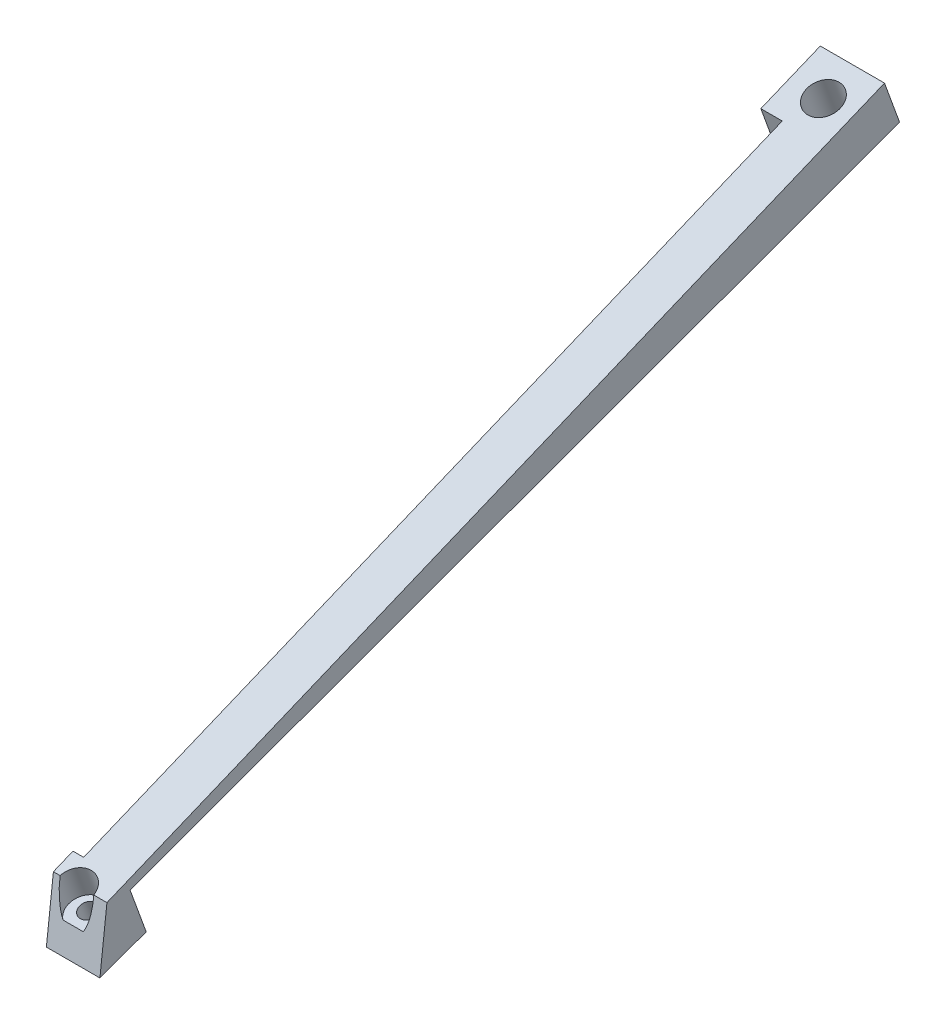
ISO-10303-21;
HEADER;
FILE_DESCRIPTION(('STEP AP214'),'2;1');
FILE_NAME('part.step','',(''),(''),'','','');
FILE_SCHEMA(('AUTOMOTIVE_DESIGN { 1 0 10303 214 1 1 1 1 }'));
ENDSEC;
DATA;
#1=APPLICATION_CONTEXT('core data for automotive mechanical design processes');
#2=APPLICATION_PROTOCOL_DEFINITION('international standard','automotive_design',2000,#1);
#3=PRODUCT_CONTEXT('',#1,'mechanical');
#4=PRODUCT('Part','Part','',(#3));
#5=PRODUCT_RELATED_PRODUCT_CATEGORY('part','',(#4));
#6=PRODUCT_DEFINITION_FORMATION('','',#4);
#7=PRODUCT_DEFINITION_CONTEXT('part definition',#1,'design');
#8=PRODUCT_DEFINITION('design','',#6,#7);
#9=PRODUCT_DEFINITION_SHAPE('','',#8);
#10=(LENGTH_UNIT() NAMED_UNIT(*) SI_UNIT(.MILLI.,.METRE.));
#11=(NAMED_UNIT(*) PLANE_ANGLE_UNIT() SI_UNIT($,.RADIAN.));
#12=(NAMED_UNIT(*) SI_UNIT($,.STERADIAN.) SOLID_ANGLE_UNIT());
#13=UNCERTAINTY_MEASURE_WITH_UNIT(LENGTH_MEASURE(1.E-05),#10,'distance_accuracy_value','');
#14=(GEOMETRIC_REPRESENTATION_CONTEXT(3) GLOBAL_UNCERTAINTY_ASSIGNED_CONTEXT((#13)) GLOBAL_UNIT_ASSIGNED_CONTEXT((#10,
#11,#12)) REPRESENTATION_CONTEXT('',''));
#15=CARTESIAN_POINT('',(0.,0.,0.));
#16=DIRECTION('',(0.,0.,1.));
#17=DIRECTION('',(1.,0.,0.));
#18=AXIS2_PLACEMENT_3D('',#15,#16,#17);
#19=CARTESIAN_POINT('',(8.,-35.7473202159316,74.6958322749875));
#20=DIRECTION('',(0.,-0.112876155748174,-0.993609064704783));
#21=DIRECTION('',(0.,-0.993609064704783,0.112876155748174));
#22=AXIS2_PLACEMENT_3D('',#19,#20,#21);
#23=PLANE('',#22);
#24=CARTESIAN_POINT('',(2.39421739533138,-24.8225562297524,73.4547552709423));
#25=DIRECTION('',(0.,0.112876155748174,0.993609064704783));
#26=DIRECTION('',(0.,0.993609064704783,-0.112876155748174));
#27=AXIS2_PLACEMENT_3D('',#24,#25,#26);
#28=ELLIPSE('',#27,7.06417920673511,3.14994015137412);
#29=CARTESIAN_POINT('',(5.53206577291514,-24.2081311688942,73.3849552446254));
#30=VERTEX_POINT('',#29);
#31=CARTESIAN_POINT('',(4.29539750685049,-30.4189504776165,74.0905178572445));
#32=VERTEX_POINT('',#31);
#33=EDGE_CURVE('E123',#30,#32,#28,.F.);
#34=ORIENTED_EDGE('',*,*,#33,.T.);
#35=DIRECTION('',(1.,0.,0.));
#36=VECTOR('',#35,1.);
#37=CARTESIAN_POINT('',(8.,-30.4189504776165,74.0905178572445));
#38=LINE('',#37,#36);
#39=CARTESIAN_POINT('',(0.493037283812277,-30.4189504776165,74.0905178572445));
#40=VERTEX_POINT('',#39);
#41=EDGE_CURVE('E130',#40,#32,#38,.T.);
#42=ORIENTED_EDGE('',*,*,#41,.F.);
#43=CARTESIAN_POINT('',(-0.743630982252375,-24.2081311688942,73.3849552446254));
#44=VERTEX_POINT('',#43);
#45=EDGE_CURVE('E125',#40,#44,#28,.F.);
#46=ORIENTED_EDGE('',*,*,#45,.T.);
#47=DIRECTION('',(-1.,0.,0.));
#48=VECTOR('',#47,1.);
#49=CARTESIAN_POINT('',(8.,-24.2081311688942,73.3849552446254));
#50=LINE('',#49,#48);
#51=CARTESIAN_POINT('',(-2.,-24.2081311688942,73.3849552446254));
#52=VERTEX_POINT('',#51);
#53=EDGE_CURVE('E209',#44,#52,#50,.T.);
#54=ORIENTED_EDGE('',*,*,#53,.T.);
#55=DIRECTION('',(0.,-0.993609064704783,0.112876155748174));
#56=VECTOR('',#55,1.);
#57=CARTESIAN_POINT('',(-2.,-25.978642362354,73.5860891757921));
#58=LINE('',#57,#56);
#59=CARTESIAN_POINT('',(-2.,-35.7473202159316,74.6958322749875));
#60=VERTEX_POINT('',#59);
#61=EDGE_CURVE('E149',#52,#60,#58,.T.);
#62=ORIENTED_EDGE('',*,*,#61,.T.);
#63=DIRECTION('',(-1.,0.,0.));
#64=VECTOR('',#63,1.);
#65=CARTESIAN_POINT('',(8.,-35.7473202159316,74.6958322749875));
#66=LINE('',#65,#64);
#67=CARTESIAN_POINT('',(8.,-35.7473202159316,74.6958322749875));
#68=VERTEX_POINT('',#67);
#69=EDGE_CURVE('E211',#68,#60,#66,.T.);
#70=ORIENTED_EDGE('',*,*,#69,.F.);
#71=DIRECTION('',(0.,0.993609064704783,-0.112876155748174));
#72=VECTOR('',#71,1.);
#73=CARTESIAN_POINT('',(8.,-35.7473202159316,74.6958322749875));
#74=LINE('',#73,#72);
#75=CARTESIAN_POINT('',(8.,-24.2081311688942,73.3849552446254));
#76=VERTEX_POINT('',#75);
#77=EDGE_CURVE('E192',#68,#76,#74,.T.);
#78=ORIENTED_EDGE('',*,*,#77,.T.);
#79=EDGE_CURVE('E138',#76,#30,#50,.T.);
#80=ORIENTED_EDGE('',*,*,#79,.T.);
#81=EDGE_LOOP('',(#34,#42,#46,#54,#62,#70,#78,#80));
#82=FACE_BOUND('',#81,.T.);
#83=ADVANCED_FACE('F35',(#82),#23,.F.);
#84=CARTESIAN_POINT('',(0.,0.,0.));
#85=DIRECTION('',(-1.,0.,0.));
#86=DIRECTION('',(0.,0.,-1.));
#87=AXIS2_PLACEMENT_3D('',#84,#85,#86);
#88=PLANE('',#87);
#89=DIRECTION('',(0.,0.381529725255829,-0.924356570132009));
#90=VECTOR('',#89,1.);
#91=CARTESIAN_POINT('',(0.,35.7473202159316,-71.8729676226761));
#92=LINE('',#91,#90);
#93=CARTESIAN_POINT('',(0.,-22.7009550134963,69.7334227705719));
#94=VERTEX_POINT('',#93);
#95=CARTESIAN_POINT('',(0.,31.1648479910877,-60.77071784216));
#96=VERTEX_POINT('',#95);
#97=EDGE_CURVE('E187',#94,#96,#92,.T.);
#98=ORIENTED_EDGE('',*,*,#97,.T.);
#99=DIRECTION('',(0.,-0.939692620785906,-0.342020143325675));
#100=VECTOR('',#99,1.);
#101=CARTESIAN_POINT('',(0.,23.8873216056215,-63.4195208255566));
#102=LINE('',#101,#100);
#103=CARTESIAN_POINT('',(0.,23.8873216056215,-63.4195208255566));
#104=VERTEX_POINT('',#103);
#105=EDGE_CURVE('E167',#96,#104,#102,.T.);
#106=ORIENTED_EDGE('',*,*,#105,.T.);
#107=DIRECTION('',(0.,-0.342020143325673,0.939692620785907));
#108=VECTOR('',#107,1.);
#109=CARTESIAN_POINT('',(0.,27.9915633255296,-74.6958322749875));
#110=LINE('',#109,#108);
#111=CARTESIAN_POINT('',(0.,-24.3314398344194,69.0604374250231));
#112=VERTEX_POINT('',#111);
#113=EDGE_CURVE('E182',#104,#112,#110,.T.);
#114=ORIENTED_EDGE('',*,*,#113,.T.);
#115=DIRECTION('',(0.,0.924356570132008,0.38152972525583));
#116=VECTOR('',#115,1.);
#117=CARTESIAN_POINT('',(0.,-24.3314398344194,69.0604374250231));
#118=LINE('',#117,#116);
#119=EDGE_CURVE('E148',#112,#94,#118,.T.);
#120=ORIENTED_EDGE('',*,*,#119,.T.);
#121=EDGE_LOOP('',(#98,#106,#114,#120));
#122=FACE_BOUND('',#121,.T.);
#123=ADVANCED_FACE('F239',(#122),#88,.T.);
#124=CARTESIAN_POINT('',(8.,27.9915633255296,-74.6958322749875));
#125=DIRECTION('',(0.,0.939692620785907,0.342020143325673));
#126=DIRECTION('',(0.,0.342020143325673,-0.939692620785907));
#127=AXIS2_PLACEMENT_3D('',#124,#125,#126);
#128=PLANE('',#127);
#129=CARTESIAN_POINT('',(2.39421739533138,25.8438455706848,-68.7950262401898));
#130=DIRECTION('',(0.,-0.939692620785907,-0.342020143325673));
#131=DIRECTION('',(0.,0.342020143325673,-0.939692620785907));
#132=AXIS2_PLACEMENT_3D('',#129,#130,#131);
#133=CIRCLE('',#132,3.14994015137412);
#134=CARTESIAN_POINT('',(2.39421739533138,26.9211885527251,-71.7550017563533));
#135=VERTEX_POINT('',#134);
#136=EDGE_CURVE('E128',#135,#135,#133,.F.);
#137=ORIENTED_EDGE('',*,*,#136,.T.);
#138=EDGE_LOOP('',(#137));
#139=FACE_BOUND('',#138,.T.);
#140=DIRECTION('',(-1.,0.,0.));
#141=VECTOR('',#140,1.);
#142=CARTESIAN_POINT('',(8.,27.9915633255296,-74.6958322749875));
#143=LINE('',#142,#141);
#144=CARTESIAN_POINT('',(8.,27.9915633255296,-74.6958322749875));
#145=VERTEX_POINT('',#144);
#146=CARTESIAN_POINT('',(-4.,27.9915633255296,-74.6958322749875));
#147=VERTEX_POINT('',#146);
#148=EDGE_CURVE('E199',#145,#147,#143,.T.);
#149=ORIENTED_EDGE('',*,*,#148,.F.);
#150=DIRECTION('',(0.,-0.342020143325673,0.939692620785907));
#151=VECTOR('',#150,1.);
#152=CARTESIAN_POINT('',(8.,27.9915633255296,-74.6958322749875));
#153=LINE('',#152,#151);
#154=CARTESIAN_POINT('',(8.,-24.3314398344194,69.0604374250231));
#155=VERTEX_POINT('',#154);
#156=EDGE_CURVE('E183',#145,#155,#153,.T.);
#157=ORIENTED_EDGE('',*,*,#156,.T.);
#158=DIRECTION('',(-1.,0.,0.));
#159=VECTOR('',#158,1.);
#160=CARTESIAN_POINT('',(8.,-24.3314398344194,69.0604374250231));
#161=LINE('',#160,#159);
#162=EDGE_CURVE('E43',#155,#112,#161,.T.);
#163=ORIENTED_EDGE('',*,*,#162,.T.);
#164=ORIENTED_EDGE('',*,*,#113,.F.);
#165=DIRECTION('',(1.,0.,0.));
#166=VECTOR('',#165,1.);
#167=CARTESIAN_POINT('',(-4.,23.8873216056215,-63.4195208255566));
#168=LINE('',#167,#166);
#169=CARTESIAN_POINT('',(-4.,23.8873216056215,-63.4195208255566));
#170=VERTEX_POINT('',#169);
#171=EDGE_CURVE('E177',#170,#104,#168,.T.);
#172=ORIENTED_EDGE('',*,*,#171,.F.);
#173=DIRECTION('',(0.,0.342020143325673,-0.939692620785907));
#174=VECTOR('',#173,1.);
#175=CARTESIAN_POINT('',(-4.,27.9915633255296,-74.6958322749875));
#176=LINE('',#175,#174);
#177=EDGE_CURVE('E174',#170,#147,#176,.T.);
#178=ORIENTED_EDGE('',*,*,#177,.T.);
#179=EDGE_LOOP('',(#149,#157,#163,#164,#172,#178));
#180=FACE_BOUND('',#179,.T.);
#181=ADVANCED_FACE('F37',(#139,#180),#128,.F.);
#182=CARTESIAN_POINT('',(8.,-24.3314398344194,69.0604374250231));
#183=DIRECTION('',(0.,-0.342020143325683,0.939692620785903));
#184=DIRECTION('',(0.,0.939692620785903,0.342020143325683));
#185=AXIS2_PLACEMENT_3D('',#182,#183,#184);
#186=PLANE('',#185);
#187=ORIENTED_EDGE('',*,*,#162,.F.);
#188=DIRECTION('',(0.,-0.939692620785903,-0.342020143325683));
#189=VECTOR('',#188,1.);
#190=CARTESIAN_POINT('',(8.,-24.3314398344194,69.0604374250231));
#191=LINE('',#190,#189);
#192=CARTESIAN_POINT('',(8.,-32.6007348973353,66.0506601637571));
#193=VERTEX_POINT('',#192);
#194=EDGE_CURVE('E186',#155,#193,#191,.T.);
#195=ORIENTED_EDGE('',*,*,#194,.T.);
#196=DIRECTION('',(-1.,0.,0.));
#197=VECTOR('',#196,1.);
#198=CARTESIAN_POINT('',(8.,-32.6007348973353,66.0506601637571));
#199=LINE('',#198,#197);
#200=CARTESIAN_POINT('',(-2.,-32.6007348973353,66.0506601637571));
#201=VERTEX_POINT('',#200);
#202=EDGE_CURVE('E214',#193,#201,#199,.T.);
#203=ORIENTED_EDGE('',*,*,#202,.T.);
#204=DIRECTION('',(0.,0.939692620785903,0.342020143325683));
#205=VECTOR('',#204,1.);
#206=CARTESIAN_POINT('',(-2.,-32.6007348973353,66.0506601637571));
#207=LINE('',#206,#205);
#208=CARTESIAN_POINT('',(-2.,-24.3314398344194,69.0604374250231));
#209=VERTEX_POINT('',#208);
#210=EDGE_CURVE('E154',#201,#209,#207,.T.);
#211=ORIENTED_EDGE('',*,*,#210,.T.);
#212=DIRECTION('',(1.,0.,0.));
#213=VECTOR('',#212,1.);
#214=CARTESIAN_POINT('',(-2.,-24.3314398344194,69.0604374250231));
#215=LINE('',#214,#213);
#216=EDGE_CURVE('E165',#209,#112,#215,.T.);
#217=ORIENTED_EDGE('',*,*,#216,.T.);
#218=EDGE_LOOP('',(#187,#195,#203,#211,#217));
#219=FACE_BOUND('',#218,.T.);
#220=ADVANCED_FACE('F252',(#219),#186,.F.);
#221=CARTESIAN_POINT('',(8.,-32.6007348973353,66.0506601637571));
#222=DIRECTION('',(0.,0.939692620785907,0.342020143325672));
#223=DIRECTION('',(0.,0.342020143325672,-0.939692620785907));
#224=AXIS2_PLACEMENT_3D('',#221,#222,#223);
#225=PLANE('',#224);
#226=CARTESIAN_POINT('',(2.39421739533138,-33.8961332877849,69.6097379907151));
#227=DIRECTION('',(0.,-0.939692620785907,-0.342020143325672));
#228=DIRECTION('',(0.,0.342020143325672,-0.939692620785907));
#229=AXIS2_PLACEMENT_3D('',#226,#227,#228);
#230=CIRCLE('',#229,1.59999999999999);
#231=CARTESIAN_POINT('',(2.39421739533138,-33.3489010584639,68.1062297974577));
#232=VERTEX_POINT('',#231);
#233=EDGE_CURVE('E142',#232,#232,#230,.F.);
#234=ORIENTED_EDGE('',*,*,#233,.T.);
#235=EDGE_LOOP('',(#234));
#236=FACE_BOUND('',#235,.T.);
#237=ORIENTED_EDGE('',*,*,#202,.F.);
#238=DIRECTION('',(0.,-0.342020143325672,0.939692620785907));
#239=VECTOR('',#238,1.);
#240=CARTESIAN_POINT('',(8.,-32.6007348973353,66.0506601637571));
#241=LINE('',#240,#239);
#242=EDGE_CURVE('E190',#193,#68,#241,.T.);
#243=ORIENTED_EDGE('',*,*,#242,.T.);
#244=ORIENTED_EDGE('',*,*,#69,.T.);
#245=DIRECTION('',(0.,0.342020143325672,-0.939692620785907));
#246=VECTOR('',#245,1.);
#247=CARTESIAN_POINT('',(-2.,-35.7473202159316,74.6958322749875));
#248=LINE('',#247,#246);
#249=EDGE_CURVE('E152',#60,#201,#248,.T.);
#250=ORIENTED_EDGE('',*,*,#249,.T.);
#251=EDGE_LOOP('',(#237,#243,#244,#250));
#252=FACE_BOUND('',#251,.T.);
#253=ADVANCED_FACE('F250',(#236,#252),#225,.F.);
#254=CARTESIAN_POINT('',(8.,35.7473202159316,-71.8729676226761));
#255=DIRECTION('',(0.,-0.924356570132009,-0.381529725255829));
#256=DIRECTION('',(0.,-0.381529725255829,0.924356570132009));
#257=AXIS2_PLACEMENT_3D('',#254,#255,#256);
#258=PLANE('',#257);
#259=CARTESIAN_POINT('',(2.39421739533138,-24.3134273367449,73.6400630334019));
#260=DIRECTION('',(0.,0.924356570132009,0.381529725255829));
#261=DIRECTION('',(0.,0.381529725255829,-0.924356570132009));
#262=AXIS2_PLACEMENT_3D('',#259,#260,#261);
#263=ELLIPSE('',#262,3.15277165798673,3.14994015137412);
#264=EDGE_CURVE('E11',#44,#30,#263,.F.);
#265=ORIENTED_EDGE('',*,*,#264,.T.);
#266=ORIENTED_EDGE('',*,*,#79,.F.);
#267=DIRECTION('',(0.,0.381529725255829,-0.924356570132009));
#268=VECTOR('',#267,1.);
#269=CARTESIAN_POINT('',(8.,35.7473202159316,-71.8729676226761));
#270=LINE('',#269,#268);
#271=CARTESIAN_POINT('',(8.,35.7473202159316,-71.8729676226761));
#272=VERTEX_POINT('',#271);
#273=EDGE_CURVE('E194',#76,#272,#270,.T.);
#274=ORIENTED_EDGE('',*,*,#273,.T.);
#275=DIRECTION('',(-1.,0.,0.));
#276=VECTOR('',#275,1.);
#277=CARTESIAN_POINT('',(8.,35.7473202159316,-71.8729676226761));
#278=LINE('',#277,#276);
#279=CARTESIAN_POINT('',(-4.,35.7473202159316,-71.8729676226761));
#280=VERTEX_POINT('',#279);
#281=EDGE_CURVE('E206',#272,#280,#278,.T.);
#282=ORIENTED_EDGE('',*,*,#281,.T.);
#283=DIRECTION('',(0.,-0.381529725255829,0.924356570132009));
#284=VECTOR('',#283,1.);
#285=CARTESIAN_POINT('',(-4.,31.1648479910877,-60.77071784216));
#286=LINE('',#285,#284);
#287=CARTESIAN_POINT('',(-4.,31.1648479910877,-60.77071784216));
#288=VERTEX_POINT('',#287);
#289=EDGE_CURVE('E170',#280,#288,#286,.T.);
#290=ORIENTED_EDGE('',*,*,#289,.T.);
#291=DIRECTION('',(1.,0.,0.));
#292=VECTOR('',#291,1.);
#293=CARTESIAN_POINT('',(-4.,31.1648479910877,-60.77071784216));
#294=LINE('',#293,#292);
#295=EDGE_CURVE('E56',#288,#96,#294,.T.);
#296=ORIENTED_EDGE('',*,*,#295,.T.);
#297=ORIENTED_EDGE('',*,*,#97,.F.);
#298=DIRECTION('',(1.,0.,0.));
#299=VECTOR('',#298,1.);
#300=CARTESIAN_POINT('',(-2.,-22.7009550134963,69.7334227705719));
#301=LINE('',#300,#299);
#302=CARTESIAN_POINT('',(-2.,-22.7009550134963,69.7334227705719));
#303=VERTEX_POINT('',#302);
#304=EDGE_CURVE('E161',#303,#94,#301,.T.);
#305=ORIENTED_EDGE('',*,*,#304,.F.);
#306=DIRECTION('',(0.,-0.381529725255829,0.924356570132009));
#307=VECTOR('',#306,1.);
#308=CARTESIAN_POINT('',(-2.,-22.7009550134963,69.7334227705719));
#309=LINE('',#308,#307);
#310=EDGE_CURVE('E159',#303,#52,#309,.T.);
#311=ORIENTED_EDGE('',*,*,#310,.T.);
#312=ORIENTED_EDGE('',*,*,#53,.F.);
#313=EDGE_LOOP('',(#265,#266,#274,#282,#290,#296,#297,#305,#311,#312));
#314=FACE_BOUND('',#313,.T.);
#315=CARTESIAN_POINT('',(2.39421739533138,33.3493481592076,-66.0632467047595));
#316=DIRECTION('',(0.,0.924356570132009,0.381529725255829));
#317=DIRECTION('',(0.,-0.381529725255829,0.924356570132009));
#318=AXIS2_PLACEMENT_3D('',#315,#316,#317);
#319=ELLIPSE('',#318,3.15277165798673,3.14994015137412);
#320=CARTESIAN_POINT('',(2.39421739533138,32.1464720547416,-63.1489615085735));
#321=VERTEX_POINT('',#320);
#322=EDGE_CURVE('E139',#321,#321,#319,.T.);
#323=ORIENTED_EDGE('',*,*,#322,.F.);
#324=EDGE_LOOP('',(#323));
#325=FACE_BOUND('',#324,.T.);
#326=ADVANCED_FACE('F248',(#314,#325),#258,.F.);
#327=CARTESIAN_POINT('',(8.,27.9915633255296,-74.6958322749875));
#328=DIRECTION('',(0.,-0.342020143325675,0.939692620785906));
#329=DIRECTION('',(0.,0.939692620785906,0.342020143325675));
#330=AXIS2_PLACEMENT_3D('',#327,#328,#329);
#331=PLANE('',#330);
#332=ORIENTED_EDGE('',*,*,#281,.F.);
#333=DIRECTION('',(0.,-0.939692620785906,-0.342020143325675));
#334=VECTOR('',#333,1.);
#335=CARTESIAN_POINT('',(8.,27.9915633255296,-74.6958322749875));
#336=LINE('',#335,#334);
#337=EDGE_CURVE('E197',#272,#145,#336,.T.);
#338=ORIENTED_EDGE('',*,*,#337,.T.);
#339=ORIENTED_EDGE('',*,*,#148,.T.);
#340=DIRECTION('',(0.,0.939692620785906,0.342020143325675));
#341=VECTOR('',#340,1.);
#342=CARTESIAN_POINT('',(-4.,27.9915633255296,-74.6958322749875));
#343=LINE('',#342,#341);
#344=EDGE_CURVE('E168',#147,#280,#343,.T.);
#345=ORIENTED_EDGE('',*,*,#344,.T.);
#346=EDGE_LOOP('',(#332,#338,#339,#345));
#347=FACE_BOUND('',#346,.T.);
#348=ADVANCED_FACE('F287',(#347),#331,.F.);
#349=CARTESIAN_POINT('',(8.,0.,0.));
#350=DIRECTION('',(-1.,0.,0.));
#351=DIRECTION('',(0.,0.,-1.));
#352=AXIS2_PLACEMENT_3D('',#349,#350,#351);
#353=PLANE('',#352);
#354=ORIENTED_EDGE('',*,*,#156,.F.);
#355=ORIENTED_EDGE('',*,*,#337,.F.);
#356=ORIENTED_EDGE('',*,*,#273,.F.);
#357=ORIENTED_EDGE('',*,*,#77,.F.);
#358=ORIENTED_EDGE('',*,*,#242,.F.);
#359=ORIENTED_EDGE('',*,*,#194,.F.);
#360=EDGE_LOOP('',(#354,#355,#356,#357,#358,#359));
#361=FACE_BOUND('',#360,.T.);
#362=ADVANCED_FACE('F266',(#361),#353,.F.);
#363=CARTESIAN_POINT('',(-4.,23.8873216056215,-63.4195208255566));
#364=DIRECTION('',(0.,0.342020143325675,-0.939692620785906));
#365=DIRECTION('',(0.,-0.939692620785906,-0.342020143325675));
#366=AXIS2_PLACEMENT_3D('',#363,#364,#365);
#367=PLANE('',#366);
#368=ORIENTED_EDGE('',*,*,#105,.F.);
#369=ORIENTED_EDGE('',*,*,#295,.F.);
#370=DIRECTION('',(0.,-0.939692620785906,-0.342020143325675));
#371=VECTOR('',#370,1.);
#372=CARTESIAN_POINT('',(-4.,23.8873216056215,-63.4195208255566));
#373=LINE('',#372,#371);
#374=EDGE_CURVE('E172',#288,#170,#373,.T.);
#375=ORIENTED_EDGE('',*,*,#374,.T.);
#376=ORIENTED_EDGE('',*,*,#171,.T.);
#377=EDGE_LOOP('',(#368,#369,#375,#376));
#378=FACE_BOUND('',#377,.T.);
#379=ADVANCED_FACE('F282',(#378),#367,.F.);
#380=CARTESIAN_POINT('',(-4.,0.,0.));
#381=DIRECTION('',(-1.,0.,0.));
#382=DIRECTION('',(0.,0.,-1.));
#383=AXIS2_PLACEMENT_3D('',#380,#381,#382);
#384=PLANE('',#383);
#385=ORIENTED_EDGE('',*,*,#344,.F.);
#386=ORIENTED_EDGE('',*,*,#177,.F.);
#387=ORIENTED_EDGE('',*,*,#374,.F.);
#388=ORIENTED_EDGE('',*,*,#289,.F.);
#389=EDGE_LOOP('',(#385,#386,#387,#388));
#390=FACE_BOUND('',#389,.T.);
#391=ADVANCED_FACE('F285',(#390),#384,.T.);
#392=CARTESIAN_POINT('',(-2.,-24.3314398344194,69.0604374250231));
#393=DIRECTION('',(0.,-0.38152972525583,0.924356570132009));
#394=DIRECTION('',(0.,0.924356570132008,0.38152972525583));
#395=AXIS2_PLACEMENT_3D('',#392,#393,#394);
#396=PLANE('',#395);
#397=ORIENTED_EDGE('',*,*,#119,.F.);
#398=ORIENTED_EDGE('',*,*,#216,.F.);
#399=DIRECTION('',(0.,0.924356570132008,0.38152972525583));
#400=VECTOR('',#399,1.);
#401=CARTESIAN_POINT('',(-2.,-24.3314398344194,69.0604374250231));
#402=LINE('',#401,#400);
#403=EDGE_CURVE('E157',#209,#303,#402,.T.);
#404=ORIENTED_EDGE('',*,*,#403,.T.);
#405=ORIENTED_EDGE('',*,*,#304,.T.);
#406=EDGE_LOOP('',(#397,#398,#404,#405));
#407=FACE_BOUND('',#406,.T.);
#408=ADVANCED_FACE('F278',(#407),#396,.F.);
#409=CARTESIAN_POINT('',(-2.,0.,0.));
#410=DIRECTION('',(-1.,0.,0.));
#411=DIRECTION('',(0.,0.,-1.));
#412=AXIS2_PLACEMENT_3D('',#409,#410,#411);
#413=PLANE('',#412);
#414=ORIENTED_EDGE('',*,*,#61,.F.);
#415=ORIENTED_EDGE('',*,*,#310,.F.);
#416=ORIENTED_EDGE('',*,*,#403,.F.);
#417=ORIENTED_EDGE('',*,*,#210,.F.);
#418=ORIENTED_EDGE('',*,*,#249,.F.);
#419=EDGE_LOOP('',(#414,#415,#416,#417,#418));
#420=FACE_BOUND('',#419,.T.);
#421=ADVANCED_FACE('F236',(#420),#413,.T.);
#422=CARTESIAN_POINT('',(2.39421739533138,-36.9031496742998,68.515273532073));
#423=DIRECTION('',(0.,0.939692620785907,0.342020143325673));
#424=DIRECTION('',(0.,0.342020143325673,-0.939692620785907));
#425=AXIS2_PLACEMENT_3D('',#422,#423,#424);
#426=CYLINDRICAL_SURFACE('',#425,1.59999999999999);
#427=CARTESIAN_POINT('',(2.39421739533138,-29.3856087080126,71.2514346786784));
#428=DIRECTION('',(0.,0.939692620785907,0.342020143325673));
#429=DIRECTION('',(0.,-0.342020143325673,0.939692620785907));
#430=AXIS2_PLACEMENT_3D('',#427,#428,#429);
#431=CIRCLE('',#430,1.59999999999999);
#432=CARTESIAN_POINT('',(2.39421739533138,-29.9328409373336,72.7549428719358));
#433=VERTEX_POINT('',#432);
#434=EDGE_CURVE('E133',#433,#433,#431,.T.);
#435=ORIENTED_EDGE('',*,*,#434,.T.);
#436=EDGE_LOOP('',(#435));
#437=FACE_BOUND('',#436,.T.);
#438=ORIENTED_EDGE('',*,*,#233,.F.);
#439=EDGE_LOOP('',(#438));
#440=FACE_BOUND('',#439,.T.);
#441=ADVANCED_FACE('F228',(#437,#440),#426,.F.);
#442=CARTESIAN_POINT('',(2.39421739533138,39.9392348824734,-63.6647240903047));
#443=DIRECTION('',(0.,-0.939692620785907,-0.342020143325673));
#444=DIRECTION('',(0.,-0.342020143325673,0.939692620785907));
#445=AXIS2_PLACEMENT_3D('',#442,#443,#444);
#446=CYLINDRICAL_SURFACE('',#445,3.14994015137412);
#447=ORIENTED_EDGE('',*,*,#322,.T.);
#448=EDGE_LOOP('',(#447));
#449=FACE_BOUND('',#448,.T.);
#450=ORIENTED_EDGE('',*,*,#136,.F.);
#451=EDGE_LOOP('',(#450));
#452=FACE_BOUND('',#451,.T.);
#453=ADVANCED_FACE('F226',(#449,#452),#446,.F.);
#454=CARTESIAN_POINT('',(2.39421739533138,-29.5599665546354,71.7304789251794));
#455=DIRECTION('',(0.,0.939692620785907,0.342020143325673));
#456=DIRECTION('',(0.,0.342020143325673,-0.939692620785907));
#457=AXIS2_PLACEMENT_3D('',#454,#455,#456);
#458=CYLINDRICAL_SURFACE('',#457,3.14994015137412);
#459=ORIENTED_EDGE('',*,*,#33,.F.);
#460=ORIENTED_EDGE('',*,*,#264,.F.);
#461=ORIENTED_EDGE('',*,*,#45,.F.);
#462=CARTESIAN_POINT('',(2.39421739533138,-29.5599665546354,71.7304789251794));
#463=DIRECTION('',(0.,0.939692620785907,0.342020143325673));
#464=DIRECTION('',(0.,-0.342020143325673,0.939692620785907));
#465=AXIS2_PLACEMENT_3D('',#462,#463,#464);
#466=CIRCLE('',#465,3.14994015137412);
#467=EDGE_CURVE('E119',#32,#40,#466,.T.);
#468=ORIENTED_EDGE('',*,*,#467,.F.);
#469=EDGE_LOOP('',(#459,#460,#461,#468));
#470=FACE_BOUND('',#469,.T.);
#471=ADVANCED_FACE('F121',(#470),#458,.F.);
#472=CARTESIAN_POINT('',(2.39421739533138,-29.5599665546354,71.7304789251794));
#473=DIRECTION('',(0.,-0.939692620785907,-0.342020143325673));
#474=DIRECTION('',(0.,-0.342020143325673,0.939692620785907));
#475=AXIS2_PLACEMENT_3D('',#472,#473,#474);
#476=PLANE('',#475);
#477=ORIENTED_EDGE('',*,*,#434,.F.);
#478=EDGE_LOOP('',(#477));
#479=FACE_BOUND('',#478,.T.);
#480=ORIENTED_EDGE('',*,*,#467,.T.);
#481=ORIENTED_EDGE('',*,*,#41,.T.);
#482=EDGE_LOOP('',(#480,#481));
#483=FACE_BOUND('',#482,.T.);
#484=ADVANCED_FACE('F131',(#479,#483),#476,.F.);
#485=CLOSED_SHELL('',(#83,#123,#181,#220,#253,#326,#348,#362,#379,#391,#408,#421,#441,#453,#471,#484));
#486=MANIFOLD_SOLID_BREP('B2',#485);
#487=ADVANCED_BREP_SHAPE_REPRESENTATION('',(#18,#486),#14);
#488=SHAPE_DEFINITION_REPRESENTATION(#9,#487);
ENDSEC;
END-ISO-10303-21;
